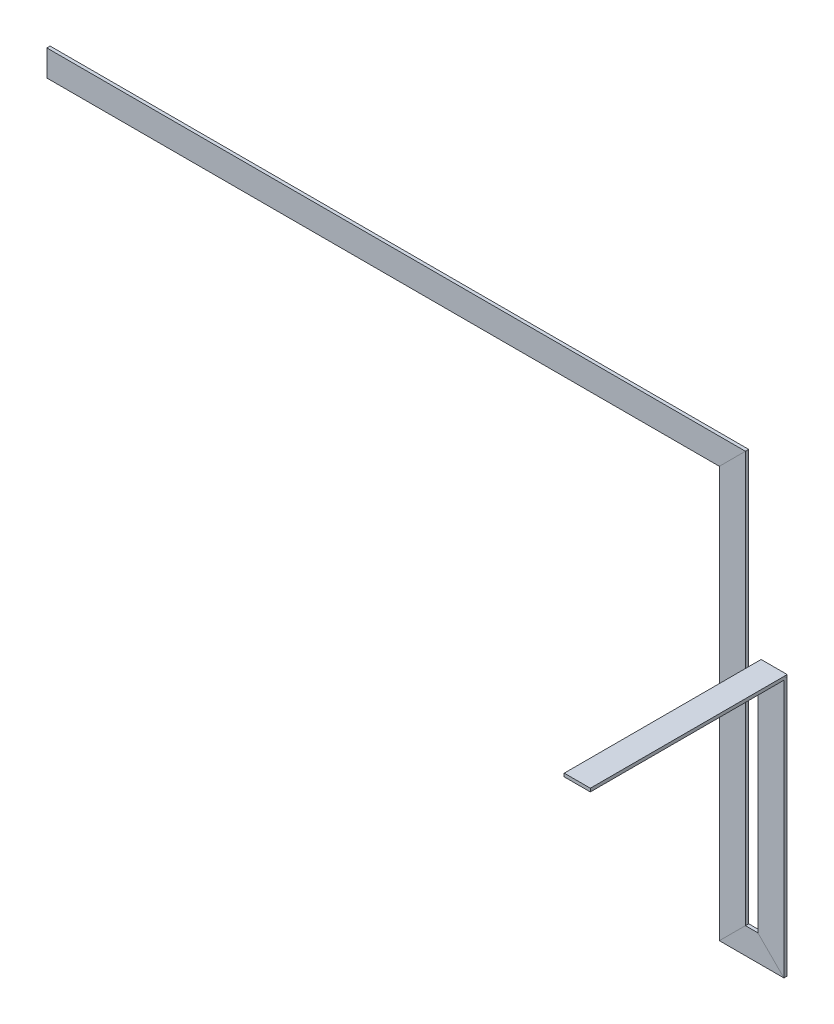
ISO-10303-21;
HEADER;
FILE_DESCRIPTION(('STEP AP214'),'2;1');
FILE_NAME('part.step','',(''),(''),'','','');
FILE_SCHEMA(('AUTOMOTIVE_DESIGN { 1 0 10303 214 1 1 1 1 }'));
ENDSEC;
DATA;
#1=APPLICATION_CONTEXT('core data for automotive mechanical design processes');
#2=APPLICATION_PROTOCOL_DEFINITION('international standard','automotive_design',2000,#1);
#3=PRODUCT_CONTEXT('',#1,'mechanical');
#4=PRODUCT('Part','Part','',(#3));
#5=PRODUCT_RELATED_PRODUCT_CATEGORY('part','',(#4));
#6=PRODUCT_DEFINITION_FORMATION('','',#4);
#7=PRODUCT_DEFINITION_CONTEXT('part definition',#1,'design');
#8=PRODUCT_DEFINITION('design','',#6,#7);
#9=PRODUCT_DEFINITION_SHAPE('','',#8);
#10=(LENGTH_UNIT() NAMED_UNIT(*) SI_UNIT(.MILLI.,.METRE.));
#11=(NAMED_UNIT(*) PLANE_ANGLE_UNIT() SI_UNIT($,.RADIAN.));
#12=(NAMED_UNIT(*) SI_UNIT($,.STERADIAN.) SOLID_ANGLE_UNIT());
#13=UNCERTAINTY_MEASURE_WITH_UNIT(LENGTH_MEASURE(1.E-05),#10,'distance_accuracy_value','');
#14=(GEOMETRIC_REPRESENTATION_CONTEXT(3) GLOBAL_UNCERTAINTY_ASSIGNED_CONTEXT((#13)) GLOBAL_UNIT_ASSIGNED_CONTEXT((#10,
#11,#12)) REPRESENTATION_CONTEXT('',''));
#15=CARTESIAN_POINT('',(0.,0.,0.));
#16=DIRECTION('',(0.,0.,1.));
#17=DIRECTION('',(1.,0.,0.));
#18=AXIS2_PLACEMENT_3D('',#15,#16,#17);
#19=CARTESIAN_POINT('',(36.8908531951066,221.0925,77.0895515510651));
#20=DIRECTION('',(0.,0.,1.));
#21=DIRECTION('',(1.,0.,0.));
#22=AXIS2_PLACEMENT_3D('',#19,#20,#21);
#23=PLANE('',#22);
#24=DIRECTION('',(0.,-1.,0.));
#25=VECTOR('',#24,1.);
#26=CARTESIAN_POINT('',(87.6908531951066,221.0925,77.0895515510651));
#27=LINE('',#26,#25);
#28=CARTESIAN_POINT('',(87.6908531951066,214.325,77.0895515510651));
#29=VERTEX_POINT('',#28);
#30=CARTESIAN_POINT('',(87.6908531951066,-287.9,77.0895515510651));
#31=VERTEX_POINT('',#30);
#32=EDGE_CURVE('E182',#29,#31,#27,.T.);
#33=ORIENTED_EDGE('',*,*,#32,.F.);
#34=DIRECTION('',(1.,0.,0.));
#35=VECTOR('',#34,1.);
#36=CARTESIAN_POINT('',(36.8908531951066,214.325,77.0895515510651));
#37=LINE('',#36,#35);
#38=CARTESIAN_POINT('',(36.8908531951066,214.325,77.0895515510651));
#39=VERTEX_POINT('',#38);
#40=EDGE_CURVE('E221',#39,#29,#37,.T.);
#41=ORIENTED_EDGE('',*,*,#40,.F.);
#42=DIRECTION('',(0.,-1.,0.));
#43=VECTOR('',#42,1.);
#44=CARTESIAN_POINT('',(36.8908531951066,221.0925,77.0895515510651));
#45=LINE('',#44,#43);
#46=CARTESIAN_POINT('',(36.8908531951066,-237.1,77.0895515510651));
#47=VERTEX_POINT('',#46);
#48=EDGE_CURVE('E187',#39,#47,#45,.T.);
#49=ORIENTED_EDGE('',*,*,#48,.T.);
#50=DIRECTION('',(0.707106781186548,-0.707106781186548,0.));
#51=VECTOR('',#50,1.);
#52=CARTESIAN_POINT('',(-192.205396804893,-8.00374999999998,77.0895515510651));
#53=LINE('',#52,#51);
#54=EDGE_CURVE('E186',#47,#31,#53,.T.);
#55=ORIENTED_EDGE('',*,*,#54,.T.);
#56=EDGE_LOOP('',(#33,#41,#49,#55));
#57=FACE_BOUND('',#56,.T.);
#58=ADVANCED_FACE('F33',(#57),#23,.T.);
#59=CARTESIAN_POINT('',(-1347.70087580489,599.790853195107,-143.585448448935));
#60=DIRECTION('',(-1.,0.,0.));
#61=DIRECTION('',(0.,-1.,0.));
#62=AXIS2_PLACEMENT_3D('',#59,#60,#61);
#63=PLANE('',#62);
#64=DIRECTION('',(0.,0.,1.));
#65=VECTOR('',#64,1.);
#66=CARTESIAN_POINT('',(-1347.70087580489,512.1,77.0895515510651));
#67=LINE('',#66,#65);
#68=CARTESIAN_POINT('',(-1347.70087580489,512.1,70.7395515510651));
#69=VERTEX_POINT('',#68);
#70=CARTESIAN_POINT('',(-1347.70087580489,512.1,77.0895515510651));
#71=VERTEX_POINT('',#70);
#72=EDGE_CURVE('E108',#69,#71,#67,.T.);
#73=ORIENTED_EDGE('',*,*,#72,.T.);
#74=DIRECTION('',(0.,1.,0.));
#75=VECTOR('',#74,1.);
#76=CARTESIAN_POINT('',(-1347.70087580489,562.9,77.0895515510651));
#77=LINE('',#76,#75);
#78=CARTESIAN_POINT('',(-1347.70087580489,562.9,77.0895515510651));
#79=VERTEX_POINT('',#78);
#80=EDGE_CURVE('E106',#71,#79,#77,.T.);
#81=ORIENTED_EDGE('',*,*,#80,.T.);
#82=DIRECTION('',(0.,0.,-1.));
#83=VECTOR('',#82,1.);
#84=CARTESIAN_POINT('',(-1347.70087580489,562.9,77.0895515510651));
#85=LINE('',#84,#83);
#86=CARTESIAN_POINT('',(-1347.70087580489,562.9,70.7395515510651));
#87=VERTEX_POINT('',#86);
#88=EDGE_CURVE('E103',#79,#87,#85,.T.);
#89=ORIENTED_EDGE('',*,*,#88,.T.);
#90=DIRECTION('',(0.,-1.,0.));
#91=VECTOR('',#90,1.);
#92=CARTESIAN_POINT('',(-1347.70087580489,562.9,70.7395515510651));
#93=LINE('',#92,#91);
#94=EDGE_CURVE('E124',#87,#69,#93,.T.);
#95=ORIENTED_EDGE('',*,*,#94,.T.);
#96=EDGE_LOOP('',(#73,#81,#89,#95));
#97=FACE_BOUND('',#96,.T.);
#98=ADVANCED_FACE('F35',(#97),#63,.T.);
#99=CARTESIAN_POINT('',(15.3308531951066,562.9,77.0895515510651));
#100=DIRECTION('',(0.,1.,0.));
#101=DIRECTION('',(0.,0.,1.));
#102=AXIS2_PLACEMENT_3D('',#99,#100,#101);
#103=PLANE('',#102);
#104=DIRECTION('',(0.,0.,1.));
#105=VECTOR('',#104,1.);
#106=CARTESIAN_POINT('',(12.6908531951066,562.9,77.0895515510651));
#107=LINE('',#106,#105);
#108=CARTESIAN_POINT('',(12.6908531951066,562.9,70.7395515510651));
#109=VERTEX_POINT('',#108);
#110=CARTESIAN_POINT('',(12.6908531951066,562.9,77.0895515510651));
#111=VERTEX_POINT('',#110);
#112=EDGE_CURVE('E141',#109,#111,#107,.T.);
#113=ORIENTED_EDGE('',*,*,#112,.F.);
#114=DIRECTION('',(-1.,0.,0.));
#115=VECTOR('',#114,1.);
#116=CARTESIAN_POINT('',(15.3308531951066,562.9,70.7395515510651));
#117=LINE('',#116,#115);
#118=EDGE_CURVE('E122',#109,#87,#117,.T.);
#119=ORIENTED_EDGE('',*,*,#118,.T.);
#120=ORIENTED_EDGE('',*,*,#88,.F.);
#121=DIRECTION('',(-1.,0.,0.));
#122=VECTOR('',#121,1.);
#123=CARTESIAN_POINT('',(15.3308531951066,562.9,77.0895515510651));
#124=LINE('',#123,#122);
#125=EDGE_CURVE('E119',#111,#79,#124,.T.);
#126=ORIENTED_EDGE('',*,*,#125,.F.);
#127=EDGE_LOOP('',(#113,#119,#120,#126));
#128=FACE_BOUND('',#127,.T.);
#129=ADVANCED_FACE('F118',(#128),#103,.T.);
#130=CARTESIAN_POINT('',(15.3308531951066,562.9,70.7395515510651));
#131=DIRECTION('',(0.,0.,-1.));
#132=DIRECTION('',(-1.,0.,0.));
#133=AXIS2_PLACEMENT_3D('',#130,#131,#132);
#134=PLANE('',#133);
#135=DIRECTION('',(0.707106781186548,0.707106781186548,0.));
#136=VECTOR('',#135,1.);
#137=CARTESIAN_POINT('',(-414.029146804893,136.18,70.7395515510651));
#138=LINE('',#137,#136);
#139=CARTESIAN_POINT('',(-38.1091468048935,512.1,70.7395515510651));
#140=VERTEX_POINT('',#139);
#141=EDGE_CURVE('E155',#140,#109,#138,.T.);
#142=ORIENTED_EDGE('',*,*,#141,.F.);
#143=DIRECTION('',(-1.,0.,0.));
#144=VECTOR('',#143,1.);
#145=CARTESIAN_POINT('',(15.3308531951066,512.1,70.7395515510651));
#146=LINE('',#145,#144);
#147=EDGE_CURVE('E133',#140,#69,#146,.T.);
#148=ORIENTED_EDGE('',*,*,#147,.T.);
#149=ORIENTED_EDGE('',*,*,#94,.F.);
#150=ORIENTED_EDGE('',*,*,#118,.F.);
#151=EDGE_LOOP('',(#142,#148,#149,#150));
#152=FACE_BOUND('',#151,.T.);
#153=ADVANCED_FACE('F362',(#152),#134,.T.);
#154=CARTESIAN_POINT('',(15.3308531951066,512.1,77.0895515510651));
#155=DIRECTION('',(0.,-1.,0.));
#156=DIRECTION('',(0.,0.,-1.));
#157=AXIS2_PLACEMENT_3D('',#154,#155,#156);
#158=PLANE('',#157);
#159=DIRECTION('',(0.,0.,-1.));
#160=VECTOR('',#159,1.);
#161=CARTESIAN_POINT('',(-38.1091468048934,512.1,77.0895515510651));
#162=LINE('',#161,#160);
#163=CARTESIAN_POINT('',(-38.1091468048935,512.1,77.0895515510651));
#164=VERTEX_POINT('',#163);
#165=EDGE_CURVE('E152',#164,#140,#162,.T.);
#166=ORIENTED_EDGE('',*,*,#165,.F.);
#167=DIRECTION('',(-1.,0.,0.));
#168=VECTOR('',#167,1.);
#169=CARTESIAN_POINT('',(15.3308531951066,512.1,77.0895515510651));
#170=LINE('',#169,#168);
#171=EDGE_CURVE('E123',#164,#71,#170,.T.);
#172=ORIENTED_EDGE('',*,*,#171,.T.);
#173=ORIENTED_EDGE('',*,*,#72,.F.);
#174=ORIENTED_EDGE('',*,*,#147,.F.);
#175=EDGE_LOOP('',(#166,#172,#173,#174));
#176=FACE_BOUND('',#175,.T.);
#177=ADVANCED_FACE('F365',(#176),#158,.T.);
#178=CARTESIAN_POINT('',(15.3308531951066,562.9,77.0895515510651));
#179=DIRECTION('',(0.,0.,1.));
#180=DIRECTION('',(1.,0.,0.));
#181=AXIS2_PLACEMENT_3D('',#178,#179,#180);
#182=PLANE('',#181);
#183=DIRECTION('',(-0.707106781186548,-0.707106781186548,0.));
#184=VECTOR('',#183,1.);
#185=CARTESIAN_POINT('',(-414.029146804893,136.18,77.0895515510651));
#186=LINE('',#185,#184);
#187=EDGE_CURVE('E128',#111,#164,#186,.T.);
#188=ORIENTED_EDGE('',*,*,#187,.F.);
#189=ORIENTED_EDGE('',*,*,#125,.T.);
#190=ORIENTED_EDGE('',*,*,#80,.F.);
#191=ORIENTED_EDGE('',*,*,#171,.F.);
#192=EDGE_LOOP('',(#188,#189,#190,#191));
#193=FACE_BOUND('',#192,.T.);
#194=ADVANCED_FACE('F126',(#193),#182,.T.);
#195=CARTESIAN_POINT('',(12.6908531951066,-290.54,77.0895515510651));
#196=DIRECTION('',(0.,0.,1.));
#197=DIRECTION('',(1.,0.,0.));
#198=AXIS2_PLACEMENT_3D('',#195,#196,#197);
#199=PLANE('',#198);
#200=DIRECTION('',(0.,1.,0.));
#201=VECTOR('',#200,1.);
#202=CARTESIAN_POINT('',(12.6908531951066,-290.54,77.0895515510651));
#203=LINE('',#202,#201);
#204=CARTESIAN_POINT('',(12.6908531951066,-237.1,77.0895515510651));
#205=VERTEX_POINT('',#204);
#206=EDGE_CURVE('E143',#205,#111,#203,.T.);
#207=ORIENTED_EDGE('',*,*,#206,.T.);
#208=ORIENTED_EDGE('',*,*,#187,.T.);
#209=DIRECTION('',(0.,1.,0.));
#210=VECTOR('',#209,1.);
#211=CARTESIAN_POINT('',(-38.1091468048934,-290.54,77.0895515510651));
#212=LINE('',#211,#210);
#213=CARTESIAN_POINT('',(-38.1091468048934,-287.9,77.0895515510651));
#214=VERTEX_POINT('',#213);
#215=EDGE_CURVE('E129',#214,#164,#212,.T.);
#216=ORIENTED_EDGE('',*,*,#215,.F.);
#217=DIRECTION('',(-0.707106781186548,-0.707106781186548,0.));
#218=VECTOR('',#217,1.);
#219=CARTESIAN_POINT('',(51.5108531951066,-198.28,77.0895515510651));
#220=LINE('',#219,#218);
#221=EDGE_CURVE('E162',#205,#214,#220,.T.);
#222=ORIENTED_EDGE('',*,*,#221,.F.);
#223=EDGE_LOOP('',(#207,#208,#216,#222));
#224=FACE_BOUND('',#223,.T.);
#225=ADVANCED_FACE('F276',(#224),#199,.T.);
#226=CARTESIAN_POINT('',(-38.1091468048934,-290.54,77.0895515510651));
#227=DIRECTION('',(-1.,0.,0.));
#228=DIRECTION('',(0.,0.,1.));
#229=AXIS2_PLACEMENT_3D('',#226,#227,#228);
#230=PLANE('',#229);
#231=ORIENTED_EDGE('',*,*,#215,.T.);
#232=ORIENTED_EDGE('',*,*,#165,.T.);
#233=DIRECTION('',(0.,1.,0.));
#234=VECTOR('',#233,1.);
#235=CARTESIAN_POINT('',(-38.1091468048934,-290.54,70.7395515510651));
#236=LINE('',#235,#234);
#237=CARTESIAN_POINT('',(-38.1091468048934,-287.9,70.7395515510651));
#238=VERTEX_POINT('',#237);
#239=EDGE_CURVE('E131',#238,#140,#236,.T.);
#240=ORIENTED_EDGE('',*,*,#239,.F.);
#241=DIRECTION('',(0.,0.,-1.));
#242=VECTOR('',#241,1.);
#243=CARTESIAN_POINT('',(-38.1091468048934,-287.9,77.0895515510651));
#244=LINE('',#243,#242);
#245=EDGE_CURVE('E176',#214,#238,#244,.T.);
#246=ORIENTED_EDGE('',*,*,#245,.F.);
#247=EDGE_LOOP('',(#231,#232,#240,#246));
#248=FACE_BOUND('',#247,.T.);
#249=ADVANCED_FACE('F274',(#248),#230,.T.);
#250=CARTESIAN_POINT('',(12.6908531951066,-290.54,70.7395515510651));
#251=DIRECTION('',(0.,0.,-1.));
#252=DIRECTION('',(-1.,0.,0.));
#253=AXIS2_PLACEMENT_3D('',#250,#251,#252);
#254=PLANE('',#253);
#255=ORIENTED_EDGE('',*,*,#239,.T.);
#256=ORIENTED_EDGE('',*,*,#141,.T.);
#257=DIRECTION('',(0.,1.,0.));
#258=VECTOR('',#257,1.);
#259=CARTESIAN_POINT('',(12.6908531951066,-290.54,70.7395515510651));
#260=LINE('',#259,#258);
#261=CARTESIAN_POINT('',(12.6908531951066,-237.1,70.7395515510651));
#262=VERTEX_POINT('',#261);
#263=EDGE_CURVE('E146',#262,#109,#260,.T.);
#264=ORIENTED_EDGE('',*,*,#263,.F.);
#265=DIRECTION('',(0.707106781186548,0.707106781186548,0.));
#266=VECTOR('',#265,1.);
#267=CARTESIAN_POINT('',(51.5108531951066,-198.28,70.7395515510651));
#268=LINE('',#267,#266);
#269=EDGE_CURVE('E179',#238,#262,#268,.T.);
#270=ORIENTED_EDGE('',*,*,#269,.F.);
#271=EDGE_LOOP('',(#255,#256,#264,#270));
#272=FACE_BOUND('',#271,.T.);
#273=ADVANCED_FACE('F351',(#272),#254,.T.);
#274=CARTESIAN_POINT('',(12.6908531951066,-290.54,77.0895515510651));
#275=DIRECTION('',(1.,0.,0.));
#276=DIRECTION('',(0.,0.,-1.));
#277=AXIS2_PLACEMENT_3D('',#274,#275,#276);
#278=PLANE('',#277);
#279=ORIENTED_EDGE('',*,*,#263,.T.);
#280=ORIENTED_EDGE('',*,*,#112,.T.);
#281=ORIENTED_EDGE('',*,*,#206,.F.);
#282=DIRECTION('',(0.,0.,1.));
#283=VECTOR('',#282,1.);
#284=CARTESIAN_POINT('',(12.6908531951066,-237.1,77.0895515510651));
#285=LINE('',#284,#283);
#286=EDGE_CURVE('E159',#262,#205,#285,.T.);
#287=ORIENTED_EDGE('',*,*,#286,.F.);
#288=EDGE_LOOP('',(#279,#280,#281,#287));
#289=FACE_BOUND('',#288,.T.);
#290=ADVANCED_FACE('F348',(#289),#278,.T.);
#291=CARTESIAN_POINT('',(90.3308531951065,-237.1,77.0895515510651));
#292=DIRECTION('',(0.,0.,1.));
#293=DIRECTION('',(1.,0.,0.));
#294=AXIS2_PLACEMENT_3D('',#291,#292,#293);
#295=PLANE('',#294);
#296=DIRECTION('',(-1.,0.,0.));
#297=VECTOR('',#296,1.);
#298=CARTESIAN_POINT('',(90.3308531951065,-237.1,77.0895515510651));
#299=LINE('',#298,#297);
#300=EDGE_CURVE('E163',#47,#205,#299,.T.);
#301=ORIENTED_EDGE('',*,*,#300,.T.);
#302=ORIENTED_EDGE('',*,*,#221,.T.);
#303=DIRECTION('',(-1.,0.,0.));
#304=VECTOR('',#303,1.);
#305=CARTESIAN_POINT('',(90.3308531951065,-287.9,77.0895515510651));
#306=LINE('',#305,#304);
#307=EDGE_CURVE('E158',#31,#214,#306,.T.);
#308=ORIENTED_EDGE('',*,*,#307,.F.);
#309=ORIENTED_EDGE('',*,*,#54,.F.);
#310=EDGE_LOOP('',(#301,#302,#308,#309));
#311=FACE_BOUND('',#310,.T.);
#312=ADVANCED_FACE('F279',(#311),#295,.T.);
#313=CARTESIAN_POINT('',(90.3308531951065,-287.9,77.0895515510651));
#314=DIRECTION('',(0.,-1.,0.));
#315=DIRECTION('',(0.,0.,-1.));
#316=AXIS2_PLACEMENT_3D('',#313,#314,#315);
#317=PLANE('',#316);
#318=ORIENTED_EDGE('',*,*,#307,.T.);
#319=ORIENTED_EDGE('',*,*,#245,.T.);
#320=DIRECTION('',(-1.,0.,0.));
#321=VECTOR('',#320,1.);
#322=CARTESIAN_POINT('',(90.3308531951065,-287.9,70.7395515510651));
#323=LINE('',#322,#321);
#324=CARTESIAN_POINT('',(87.6908531951066,-287.9,70.7395515510651));
#325=VERTEX_POINT('',#324);
#326=EDGE_CURVE('E169',#325,#238,#323,.T.);
#327=ORIENTED_EDGE('',*,*,#326,.F.);
#328=DIRECTION('',(0.,0.,-1.));
#329=VECTOR('',#328,1.);
#330=CARTESIAN_POINT('',(87.6908531951066,-287.9,77.0895515510651));
#331=LINE('',#330,#329);
#332=EDGE_CURVE('E196',#31,#325,#331,.T.);
#333=ORIENTED_EDGE('',*,*,#332,.F.);
#334=EDGE_LOOP('',(#318,#319,#327,#333));
#335=FACE_BOUND('',#334,.T.);
#336=ADVANCED_FACE('F269',(#335),#317,.T.);
#337=CARTESIAN_POINT('',(90.3308531951065,-237.1,70.7395515510651));
#338=DIRECTION('',(0.,0.,-1.));
#339=DIRECTION('',(-1.,0.,0.));
#340=AXIS2_PLACEMENT_3D('',#337,#338,#339);
#341=PLANE('',#340);
#342=ORIENTED_EDGE('',*,*,#326,.T.);
#343=ORIENTED_EDGE('',*,*,#269,.T.);
#344=DIRECTION('',(-1.,0.,0.));
#345=VECTOR('',#344,1.);
#346=CARTESIAN_POINT('',(90.3308531951065,-237.1,70.7395515510651));
#347=LINE('',#346,#345);
#348=CARTESIAN_POINT('',(36.8908531951066,-237.1,70.7395515510651));
#349=VERTEX_POINT('',#348);
#350=EDGE_CURVE('E166',#349,#262,#347,.T.);
#351=ORIENTED_EDGE('',*,*,#350,.F.);
#352=DIRECTION('',(-0.707106781186548,0.707106781186548,0.));
#353=VECTOR('',#352,1.);
#354=CARTESIAN_POINT('',(-192.205396804893,-8.00374999999998,70.7395515510651));
#355=LINE('',#354,#353);
#356=EDGE_CURVE('E199',#325,#349,#355,.T.);
#357=ORIENTED_EDGE('',*,*,#356,.F.);
#358=EDGE_LOOP('',(#342,#343,#351,#357));
#359=FACE_BOUND('',#358,.T.);
#360=ADVANCED_FACE('F267',(#359),#341,.T.);
#361=CARTESIAN_POINT('',(90.3308531951065,-237.1,77.0895515510651));
#362=DIRECTION('',(0.,1.,0.));
#363=DIRECTION('',(0.,0.,1.));
#364=AXIS2_PLACEMENT_3D('',#361,#362,#363);
#365=PLANE('',#364);
#366=ORIENTED_EDGE('',*,*,#350,.T.);
#367=ORIENTED_EDGE('',*,*,#286,.T.);
#368=ORIENTED_EDGE('',*,*,#300,.F.);
#369=DIRECTION('',(0.,0.,1.));
#370=VECTOR('',#369,1.);
#371=CARTESIAN_POINT('',(36.8908531951066,-237.1,77.0895515510651));
#372=LINE('',#371,#370);
#373=EDGE_CURVE('E183',#349,#47,#372,.T.);
#374=ORIENTED_EDGE('',*,*,#373,.F.);
#375=EDGE_LOOP('',(#366,#367,#368,#374));
#376=FACE_BOUND('',#375,.T.);
#377=ADVANCED_FACE('F284',(#376),#365,.T.);
#378=CARTESIAN_POINT('',(87.6908531951066,221.0925,77.0895515510651));
#379=DIRECTION('',(1.,0.,0.));
#380=DIRECTION('',(0.,0.,-1.));
#381=AXIS2_PLACEMENT_3D('',#378,#379,#380);
#382=PLANE('',#381);
#383=DIRECTION('',(0.,-0.707106781186548,-0.707106781186548));
#384=VECTOR('',#383,1.);
#385=CARTESIAN_POINT('',(87.6908531951066,182.130224224467,38.5447757755325));
#386=LINE('',#385,#384);
#387=CARTESIAN_POINT('',(87.6908531951066,220.675,77.0895515510651));
#388=VERTEX_POINT('',#387);
#389=CARTESIAN_POINT('',(87.6908531951066,214.325,70.7395515510651));
#390=VERTEX_POINT('',#389);
#391=EDGE_CURVE('E42',#388,#390,#386,.T.);
#392=ORIENTED_EDGE('',*,*,#391,.F.);
#393=DIRECTION('',(0.,0.,-1.));
#394=VECTOR('',#393,1.);
#395=CARTESIAN_POINT('',(87.6908531951066,220.675,454.089551551065));
#396=LINE('',#395,#394);
#397=CARTESIAN_POINT('',(87.6908531951066,220.675,454.089551551065));
#398=VERTEX_POINT('',#397);
#399=EDGE_CURVE('E218',#398,#388,#396,.T.);
#400=ORIENTED_EDGE('',*,*,#399,.F.);
#401=DIRECTION('',(0.,1.,0.));
#402=VECTOR('',#401,1.);
#403=CARTESIAN_POINT('',(87.6908531951066,214.325,454.089551551065));
#404=LINE('',#403,#402);
#405=CARTESIAN_POINT('',(87.6908531951066,214.325,454.089551551065));
#406=VERTEX_POINT('',#405);
#407=EDGE_CURVE('E220',#406,#398,#404,.T.);
#408=ORIENTED_EDGE('',*,*,#407,.F.);
#409=DIRECTION('',(0.,0.,-1.));
#410=VECTOR('',#409,1.);
#411=CARTESIAN_POINT('',(87.6908531951066,214.325,454.089551551065));
#412=LINE('',#411,#410);
#413=EDGE_CURVE('E215',#406,#29,#412,.T.);
#414=ORIENTED_EDGE('',*,*,#413,.T.);
#415=ORIENTED_EDGE('',*,*,#32,.T.);
#416=ORIENTED_EDGE('',*,*,#332,.T.);
#417=DIRECTION('',(0.,-1.,0.));
#418=VECTOR('',#417,1.);
#419=CARTESIAN_POINT('',(87.6908531951066,221.0925,70.7395515510651));
#420=LINE('',#419,#418);
#421=EDGE_CURVE('E191',#390,#325,#420,.T.);
#422=ORIENTED_EDGE('',*,*,#421,.F.);
#423=EDGE_LOOP('',(#392,#400,#408,#414,#415,#416,#422));
#424=FACE_BOUND('',#423,.T.);
#425=ADVANCED_FACE('F259',(#424),#382,.T.);
#426=CARTESIAN_POINT('',(36.8908531951066,221.0925,70.7395515510651));
#427=DIRECTION('',(0.,0.,-1.));
#428=DIRECTION('',(-1.,0.,0.));
#429=AXIS2_PLACEMENT_3D('',#426,#427,#428);
#430=PLANE('',#429);
#431=ORIENTED_EDGE('',*,*,#421,.T.);
#432=ORIENTED_EDGE('',*,*,#356,.T.);
#433=DIRECTION('',(0.,-1.,0.));
#434=VECTOR('',#433,1.);
#435=CARTESIAN_POINT('',(36.8908531951066,221.0925,70.7395515510651));
#436=LINE('',#435,#434);
#437=CARTESIAN_POINT('',(36.8908531951066,214.325,70.7395515510651));
#438=VERTEX_POINT('',#437);
#439=EDGE_CURVE('E189',#438,#349,#436,.T.);
#440=ORIENTED_EDGE('',*,*,#439,.F.);
#441=DIRECTION('',(0.,1.,0.));
#442=VECTOR('',#441,1.);
#443=CARTESIAN_POINT('',(36.8908531951066,220.675,70.7395515510651));
#444=LINE('',#443,#442);
#445=CARTESIAN_POINT('',(36.8908531951065,220.675,70.7395515510651));
#446=VERTEX_POINT('',#445);
#447=EDGE_CURVE('E11',#438,#446,#444,.T.);
#448=ORIENTED_EDGE('',*,*,#447,.T.);
#449=DIRECTION('',(1.,0.,0.));
#450=VECTOR('',#449,1.);
#451=CARTESIAN_POINT('',(36.8908531951065,220.675,70.7395515510651));
#452=LINE('',#451,#450);
#453=CARTESIAN_POINT('',(87.6908531951066,220.675,70.7395515510651));
#454=VERTEX_POINT('',#453);
#455=EDGE_CURVE('E237',#446,#454,#452,.T.);
#456=ORIENTED_EDGE('',*,*,#455,.T.);
#457=DIRECTION('',(0.,1.,0.));
#458=VECTOR('',#457,1.);
#459=CARTESIAN_POINT('',(87.6908531951066,212.675,70.7395515510651));
#460=LINE('',#459,#458);
#461=EDGE_CURVE('E225',#390,#454,#460,.T.);
#462=ORIENTED_EDGE('',*,*,#461,.F.);
#463=EDGE_LOOP('',(#431,#432,#440,#448,#456,#462));
#464=FACE_BOUND('',#463,.T.);
#465=ADVANCED_FACE('F243',(#464),#430,.T.);
#466=CARTESIAN_POINT('',(36.8908531951066,221.0925,77.0895515510651));
#467=DIRECTION('',(-1.,0.,0.));
#468=DIRECTION('',(0.,0.,1.));
#469=AXIS2_PLACEMENT_3D('',#466,#467,#468);
#470=PLANE('',#469);
#471=ORIENTED_EDGE('',*,*,#439,.T.);
#472=ORIENTED_EDGE('',*,*,#373,.T.);
#473=ORIENTED_EDGE('',*,*,#48,.F.);
#474=DIRECTION('',(0.,0.,-1.));
#475=VECTOR('',#474,1.);
#476=CARTESIAN_POINT('',(36.8908531951066,214.325,454.089551551065));
#477=LINE('',#476,#475);
#478=CARTESIAN_POINT('',(36.8908531951066,214.325,454.089551551065));
#479=VERTEX_POINT('',#478);
#480=EDGE_CURVE('E212',#479,#39,#477,.T.);
#481=ORIENTED_EDGE('',*,*,#480,.F.);
#482=DIRECTION('',(0.,-1.,0.));
#483=VECTOR('',#482,1.);
#484=CARTESIAN_POINT('',(36.8908531951066,220.675,454.089551551065));
#485=LINE('',#484,#483);
#486=CARTESIAN_POINT('',(36.8908531951066,220.675,454.089551551065));
#487=VERTEX_POINT('',#486);
#488=EDGE_CURVE('E231',#487,#479,#485,.T.);
#489=ORIENTED_EDGE('',*,*,#488,.F.);
#490=DIRECTION('',(0.,0.,-1.));
#491=VECTOR('',#490,1.);
#492=CARTESIAN_POINT('',(36.8908531951066,220.675,454.089551551065));
#493=LINE('',#492,#491);
#494=CARTESIAN_POINT('',(36.8908531951066,220.675,77.0895515510651));
#495=VERTEX_POINT('',#494);
#496=EDGE_CURVE('E113',#487,#495,#493,.T.);
#497=ORIENTED_EDGE('',*,*,#496,.T.);
#498=DIRECTION('',(0.,0.707106781186548,0.707106781186548));
#499=VECTOR('',#498,1.);
#500=CARTESIAN_POINT('',(36.8908531951066,182.130224224467,38.5447757755325));
#501=LINE('',#500,#499);
#502=EDGE_CURVE('E203',#438,#495,#501,.T.);
#503=ORIENTED_EDGE('',*,*,#502,.F.);
#504=EDGE_LOOP('',(#471,#472,#473,#481,#489,#497,#503));
#505=FACE_BOUND('',#504,.T.);
#506=ADVANCED_FACE('F287',(#505),#470,.T.);
#507=CARTESIAN_POINT('',(36.8908531951066,220.675,0.));
#508=DIRECTION('',(0.,1.,0.));
#509=DIRECTION('',(0.,0.,1.));
#510=AXIS2_PLACEMENT_3D('',#507,#508,#509);
#511=PLANE('',#510);
#512=ORIENTED_EDGE('',*,*,#455,.F.);
#513=DIRECTION('',(0.,0.,1.));
#514=VECTOR('',#513,1.);
#515=CARTESIAN_POINT('',(36.8908531951066,220.675,0.));
#516=LINE('',#515,#514);
#517=EDGE_CURVE('E202',#446,#495,#516,.T.);
#518=ORIENTED_EDGE('',*,*,#517,.T.);
#519=ORIENTED_EDGE('',*,*,#496,.F.);
#520=DIRECTION('',(-1.,0.,0.));
#521=VECTOR('',#520,1.);
#522=CARTESIAN_POINT('',(87.6908531951066,220.675,454.089551551065));
#523=LINE('',#522,#521);
#524=EDGE_CURVE('E224',#398,#487,#523,.T.);
#525=ORIENTED_EDGE('',*,*,#524,.F.);
#526=ORIENTED_EDGE('',*,*,#399,.T.);
#527=DIRECTION('',(0.,0.,1.));
#528=VECTOR('',#527,1.);
#529=CARTESIAN_POINT('',(87.6908531951066,220.675,0.));
#530=LINE('',#529,#528);
#531=EDGE_CURVE('E50',#454,#388,#530,.T.);
#532=ORIENTED_EDGE('',*,*,#531,.F.);
#533=EDGE_LOOP('',(#512,#518,#519,#525,#526,#532));
#534=FACE_BOUND('',#533,.T.);
#535=ADVANCED_FACE('F253',(#534),#511,.T.);
#536=CARTESIAN_POINT('',(87.6908531951066,220.675,0.));
#537=DIRECTION('',(1.,0.,0.));
#538=DIRECTION('',(0.,0.,-1.));
#539=AXIS2_PLACEMENT_3D('',#536,#537,#538);
#540=PLANE('',#539);
#541=ORIENTED_EDGE('',*,*,#461,.T.);
#542=ORIENTED_EDGE('',*,*,#531,.T.);
#543=ORIENTED_EDGE('',*,*,#391,.T.);
#544=EDGE_LOOP('',(#541,#542,#543));
#545=FACE_BOUND('',#544,.T.);
#546=ADVANCED_FACE('F251',(#545),#540,.T.);
#547=CARTESIAN_POINT('',(36.8908531951066,220.675,0.));
#548=DIRECTION('',(-1.,0.,0.));
#549=DIRECTION('',(0.,0.,1.));
#550=AXIS2_PLACEMENT_3D('',#547,#548,#549);
#551=PLANE('',#550);
#552=ORIENTED_EDGE('',*,*,#447,.F.);
#553=ORIENTED_EDGE('',*,*,#502,.T.);
#554=ORIENTED_EDGE('',*,*,#517,.F.);
#555=EDGE_LOOP('',(#552,#553,#554));
#556=FACE_BOUND('',#555,.T.);
#557=ADVANCED_FACE('F293',(#556),#551,.T.);
#558=CARTESIAN_POINT('',(36.8908531951066,214.325,454.089551551065));
#559=DIRECTION('',(0.,1.,0.));
#560=DIRECTION('',(0.,0.,1.));
#561=AXIS2_PLACEMENT_3D('',#558,#559,#560);
#562=PLANE('',#561);
#563=ORIENTED_EDGE('',*,*,#40,.T.);
#564=ORIENTED_EDGE('',*,*,#413,.F.);
#565=DIRECTION('',(1.,0.,0.));
#566=VECTOR('',#565,1.);
#567=CARTESIAN_POINT('',(36.8908531951066,214.325,454.089551551065));
#568=LINE('',#567,#566);
#569=EDGE_CURVE('E228',#479,#406,#568,.T.);
#570=ORIENTED_EDGE('',*,*,#569,.F.);
#571=ORIENTED_EDGE('',*,*,#480,.T.);
#572=EDGE_LOOP('',(#563,#564,#570,#571));
#573=FACE_BOUND('',#572,.T.);
#574=ADVANCED_FACE('F317',(#573),#562,.F.);
#575=CARTESIAN_POINT('',(0.,0.,454.089551551065));
#576=DIRECTION('',(0.,0.,1.));
#577=DIRECTION('',(1.,0.,0.));
#578=AXIS2_PLACEMENT_3D('',#575,#576,#577);
#579=PLANE('',#578);
#580=ORIENTED_EDGE('',*,*,#524,.T.);
#581=ORIENTED_EDGE('',*,*,#488,.T.);
#582=ORIENTED_EDGE('',*,*,#569,.T.);
#583=ORIENTED_EDGE('',*,*,#407,.T.);
#584=EDGE_LOOP('',(#580,#581,#582,#583));
#585=FACE_BOUND('',#584,.T.);
#586=ADVANCED_FACE('F309',(#585),#579,.T.);
#587=CLOSED_SHELL('',(#58,#98,#129,#153,#177,#194,#225,#249,#273,#290,#312,#336,#360,#377,#425,
#465,#506,#535,#546,#557,#574,#586));
#588=MANIFOLD_SOLID_BREP('B2',#587);
#589=ADVANCED_BREP_SHAPE_REPRESENTATION('',(#18,#588),#14);
#590=SHAPE_DEFINITION_REPRESENTATION(#9,#589);
ENDSEC;
END-ISO-10303-21;
